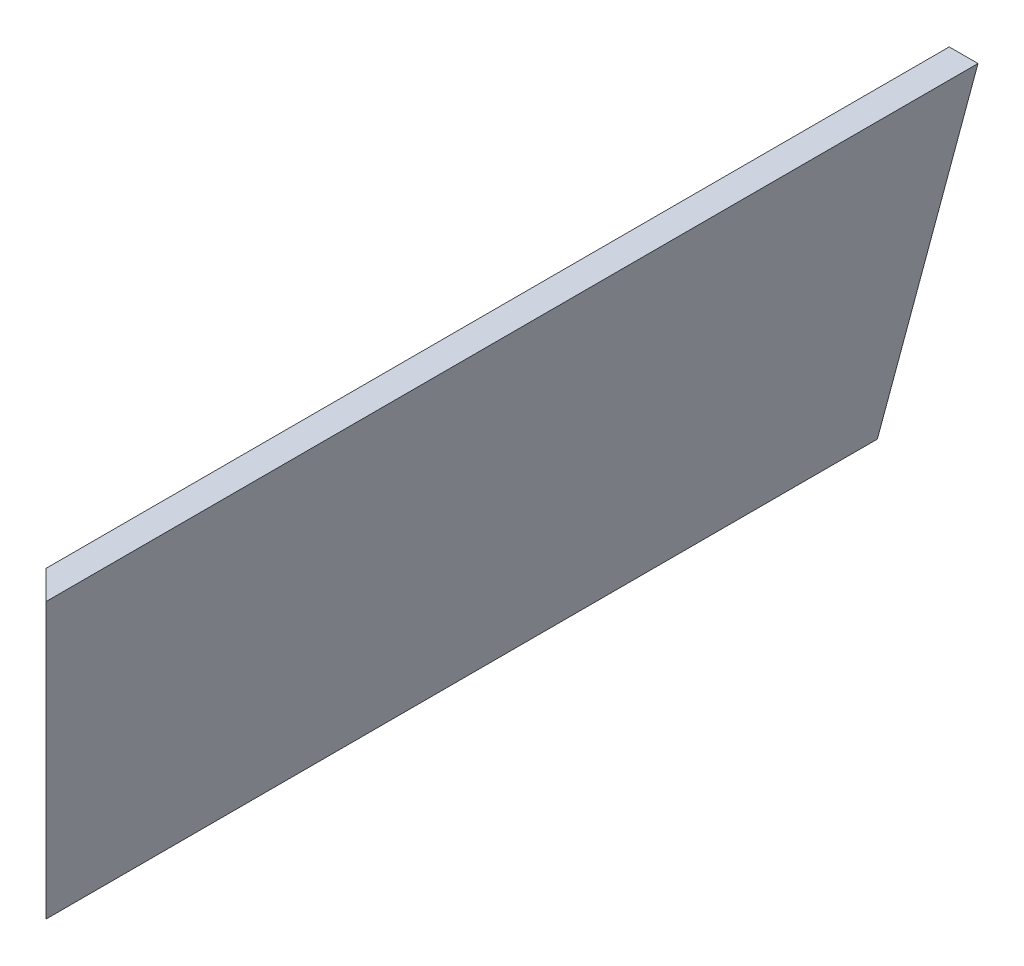
ISO-10303-21;
HEADER;
FILE_DESCRIPTION(('STEP AP214'),'2;1');
FILE_NAME('part.step','',(''),(''),'','','');
FILE_SCHEMA(('AUTOMOTIVE_DESIGN { 1 0 10303 214 1 1 1 1 }'));
ENDSEC;
DATA;
#1=APPLICATION_CONTEXT('core data for automotive mechanical design processes');
#2=APPLICATION_PROTOCOL_DEFINITION('international standard','automotive_design',2000,#1);
#3=PRODUCT_CONTEXT('',#1,'mechanical');
#4=PRODUCT('Part','Part','',(#3));
#5=PRODUCT_RELATED_PRODUCT_CATEGORY('part','',(#4));
#6=PRODUCT_DEFINITION_FORMATION('','',#4);
#7=PRODUCT_DEFINITION_CONTEXT('part definition',#1,'design');
#8=PRODUCT_DEFINITION('design','',#6,#7);
#9=PRODUCT_DEFINITION_SHAPE('','',#8);
#10=(LENGTH_UNIT() NAMED_UNIT(*) SI_UNIT(.MILLI.,.METRE.));
#11=(NAMED_UNIT(*) PLANE_ANGLE_UNIT() SI_UNIT($,.RADIAN.));
#12=(NAMED_UNIT(*) SI_UNIT($,.STERADIAN.) SOLID_ANGLE_UNIT());
#13=UNCERTAINTY_MEASURE_WITH_UNIT(LENGTH_MEASURE(1.E-05),#10,'distance_accuracy_value','');
#14=(GEOMETRIC_REPRESENTATION_CONTEXT(3) GLOBAL_UNCERTAINTY_ASSIGNED_CONTEXT((#13)) GLOBAL_UNIT_ASSIGNED_CONTEXT((#10,
#11,#12)) REPRESENTATION_CONTEXT('',''));
#15=CARTESIAN_POINT('',(0.,0.,0.));
#16=DIRECTION('',(0.,0.,1.));
#17=DIRECTION('',(1.,0.,0.));
#18=AXIS2_PLACEMENT_3D('',#15,#16,#17);
#19=CARTESIAN_POINT('',(412.955618728019,171.741611914197,615.788493715292));
#20=DIRECTION('',(0.96592582628907,-0.258819045102514,0.));
#21=DIRECTION('',(0.258819045102514,0.96592582628907,0.));
#22=AXIS2_PLACEMENT_3D('',#19,#20,#21);
#23=PLANE('',#22);
#24=DIRECTION('',(-0.250562807085726,-0.935113126531033,-0.250562807085726));
#25=VECTOR('',#24,1.);
#26=CARTESIAN_POINT('',(425.689815552035,219.26628145501,425.689815552035));
#27=LINE('',#26,#25);
#28=CARTESIAN_POINT('',(412.955618728019,171.741611914197,412.955618728019));
#29=VERTEX_POINT('',#28);
#30=CARTESIAN_POINT('',(366.937592508792,0.,366.937592508792));
#31=VERTEX_POINT('',#30);
#32=EDGE_CURVE('E90',#29,#31,#27,.T.);
#33=ORIENTED_EDGE('',*,*,#32,.F.);
#34=DIRECTION('',(0.,0.,-1.));
#35=VECTOR('',#34,1.);
#36=CARTESIAN_POINT('',(412.955618728019,171.741611914197,615.788493715292));
#37=LINE('',#36,#35);
#38=CARTESIAN_POINT('',(412.955618728019,171.741611914197,0.));
#39=VERTEX_POINT('',#38);
#40=EDGE_CURVE('E43',#29,#39,#37,.T.);
#41=ORIENTED_EDGE('',*,*,#40,.T.);
#42=DIRECTION('',(-0.258819045102514,-0.96592582628907,0.));
#43=VECTOR('',#42,1.);
#44=CARTESIAN_POINT('',(412.955618728019,171.741611914197,0.));
#45=LINE('',#44,#43);
#46=CARTESIAN_POINT('',(366.937592508792,0.,0.));
#47=VERTEX_POINT('',#46);
#48=EDGE_CURVE('E88',#39,#47,#45,.T.);
#49=ORIENTED_EDGE('',*,*,#48,.T.);
#50=DIRECTION('',(0.,0.,-1.));
#51=VECTOR('',#50,1.);
#52=CARTESIAN_POINT('',(366.937592508792,0.,615.788493715292));
#53=LINE('',#52,#51);
#54=EDGE_CURVE('E79',#31,#47,#53,.T.);
#55=ORIENTED_EDGE('',*,*,#54,.F.);
#56=EDGE_LOOP('',(#33,#41,#49,#55));
#57=FACE_BOUND('',#56,.T.);
#58=ADVANCED_FACE('F39',(#57),#23,.F.);
#59=CARTESIAN_POINT('',(366.937592508792,0.,615.788493715292));
#60=DIRECTION('',(0.,1.,0.));
#61=DIRECTION('',(0.,0.,1.));
#62=AXIS2_PLACEMENT_3D('',#59,#60,#61);
#63=PLANE('',#62);
#64=DIRECTION('',(0.707106781186548,0.,0.707106781186547));
#65=VECTOR('',#64,1.);
#66=CARTESIAN_POINT('',(491.363043112042,0.,491.363043112042));
#67=LINE('',#66,#65);
#68=CARTESIAN_POINT('',(380.0856,0.,380.0856));
#69=VERTEX_POINT('',#68);
#70=EDGE_CURVE('E49',#31,#69,#67,.T.);
#71=ORIENTED_EDGE('',*,*,#70,.F.);
#72=ORIENTED_EDGE('',*,*,#54,.T.);
#73=DIRECTION('',(1.,0.,0.));
#74=VECTOR('',#73,1.);
#75=CARTESIAN_POINT('',(366.937592508792,0.,0.));
#76=LINE('',#75,#74);
#77=CARTESIAN_POINT('',(380.0856,0.,0.));
#78=VERTEX_POINT('',#77);
#79=EDGE_CURVE('E102',#47,#78,#76,.T.);
#80=ORIENTED_EDGE('',*,*,#79,.T.);
#81=DIRECTION('',(0.,0.,-1.));
#82=VECTOR('',#81,1.);
#83=CARTESIAN_POINT('',(380.0856,0.,615.788493715292));
#84=LINE('',#83,#82);
#85=EDGE_CURVE('E116',#69,#78,#84,.T.);
#86=ORIENTED_EDGE('',*,*,#85,.F.);
#87=EDGE_LOOP('',(#71,#72,#80,#86));
#88=FACE_BOUND('',#87,.T.);
#89=ADVANCED_FACE('F123',(#88),#63,.F.);
#90=CARTESIAN_POINT('',(380.0856,0.,615.788493715292));
#91=DIRECTION('',(-0.96592582628907,0.258819045102514,0.));
#92=DIRECTION('',(-0.258819045102514,-0.96592582628907,0.));
#93=AXIS2_PLACEMENT_3D('',#90,#91,#92);
#94=PLANE('',#93);
#95=DIRECTION('',(0.250562807085725,0.935113126531033,0.250562807085725));
#96=VECTOR('',#95,1.);
#97=CARTESIAN_POINT('',(394.88343314588,55.2262651423517,394.88343314588));
#98=LINE('',#97,#96);
#99=CARTESIAN_POINT('',(426.103626219227,171.741611914197,426.103626219227));
#100=VERTEX_POINT('',#99);
#101=EDGE_CURVE('E11',#69,#100,#98,.T.);
#102=ORIENTED_EDGE('',*,*,#101,.F.);
#103=ORIENTED_EDGE('',*,*,#85,.T.);
#104=DIRECTION('',(0.258819045102514,0.96592582628907,0.));
#105=VECTOR('',#104,1.);
#106=CARTESIAN_POINT('',(380.0856,0.,0.));
#107=LINE('',#106,#105);
#108=CARTESIAN_POINT('',(426.103626219227,171.741611914197,0.));
#109=VERTEX_POINT('',#108);
#110=EDGE_CURVE('E118',#78,#109,#107,.T.);
#111=ORIENTED_EDGE('',*,*,#110,.T.);
#112=DIRECTION('',(0.,0.,-1.));
#113=VECTOR('',#112,1.);
#114=CARTESIAN_POINT('',(426.103626219227,171.741611914197,615.788493715292));
#115=LINE('',#114,#113);
#116=EDGE_CURVE('E62',#100,#109,#115,.T.);
#117=ORIENTED_EDGE('',*,*,#116,.F.);
#118=EDGE_LOOP('',(#102,#103,#111,#117));
#119=FACE_BOUND('',#118,.T.);
#120=ADVANCED_FACE('F122',(#119),#94,.F.);
#121=CARTESIAN_POINT('',(426.103626219227,171.741611914197,615.788493715292));
#122=DIRECTION('',(0.,-1.,0.));
#123=DIRECTION('',(0.,0.,-1.));
#124=AXIS2_PLACEMENT_3D('',#121,#122,#123);
#125=PLANE('',#124);
#126=DIRECTION('',(-0.707106781186548,0.,-0.707106781186547));
#127=VECTOR('',#126,1.);
#128=CARTESIAN_POINT('',(520.94605996726,171.741611914197,520.946059967259));
#129=LINE('',#128,#127);
#130=EDGE_CURVE('E99',#100,#29,#129,.T.);
#131=ORIENTED_EDGE('',*,*,#130,.F.);
#132=ORIENTED_EDGE('',*,*,#116,.T.);
#133=DIRECTION('',(-1.,0.,0.));
#134=VECTOR('',#133,1.);
#135=CARTESIAN_POINT('',(426.103626219227,171.741611914197,0.));
#136=LINE('',#135,#134);
#137=EDGE_CURVE('E94',#109,#39,#136,.T.);
#138=ORIENTED_EDGE('',*,*,#137,.T.);
#139=ORIENTED_EDGE('',*,*,#40,.F.);
#140=EDGE_LOOP('',(#131,#132,#138,#139));
#141=FACE_BOUND('',#140,.T.);
#142=ADVANCED_FACE('F95',(#141),#125,.F.);
#143=CARTESIAN_POINT('',(0.,0.,0.));
#144=DIRECTION('',(0.,0.,1.));
#145=DIRECTION('',(1.,0.,0.));
#146=AXIS2_PLACEMENT_3D('',#143,#144,#145);
#147=PLANE('',#146);
#148=ORIENTED_EDGE('',*,*,#48,.F.);
#149=ORIENTED_EDGE('',*,*,#137,.F.);
#150=ORIENTED_EDGE('',*,*,#110,.F.);
#151=ORIENTED_EDGE('',*,*,#79,.F.);
#152=EDGE_LOOP('',(#148,#149,#150,#151));
#153=FACE_BOUND('',#152,.T.);
#154=ADVANCED_FACE('F101',(#153),#147,.F.);
#155=CARTESIAN_POINT('',(0.,0.,0.));
#156=DIRECTION('',(-0.707106781186547,0.,0.707106781186548));
#157=DIRECTION('',(0.707106781186548,0.,0.707106781186547));
#158=AXIS2_PLACEMENT_3D('',#155,#156,#157);
#159=PLANE('',#158);
#160=ORIENTED_EDGE('',*,*,#130,.T.);
#161=ORIENTED_EDGE('',*,*,#32,.T.);
#162=ORIENTED_EDGE('',*,*,#70,.T.);
#163=ORIENTED_EDGE('',*,*,#101,.T.);
#164=EDGE_LOOP('',(#160,#161,#162,#163));
#165=FACE_BOUND('',#164,.T.);
#166=ADVANCED_FACE('F41',(#165),#159,.T.);
#167=CLOSED_SHELL('',(#58,#89,#120,#142,#154,#166));
#168=MANIFOLD_SOLID_BREP('B2',#167);
#169=ADVANCED_BREP_SHAPE_REPRESENTATION('',(#18,#168),#14);
#170=SHAPE_DEFINITION_REPRESENTATION(#9,#169);
ENDSEC;
END-ISO-10303-21;
